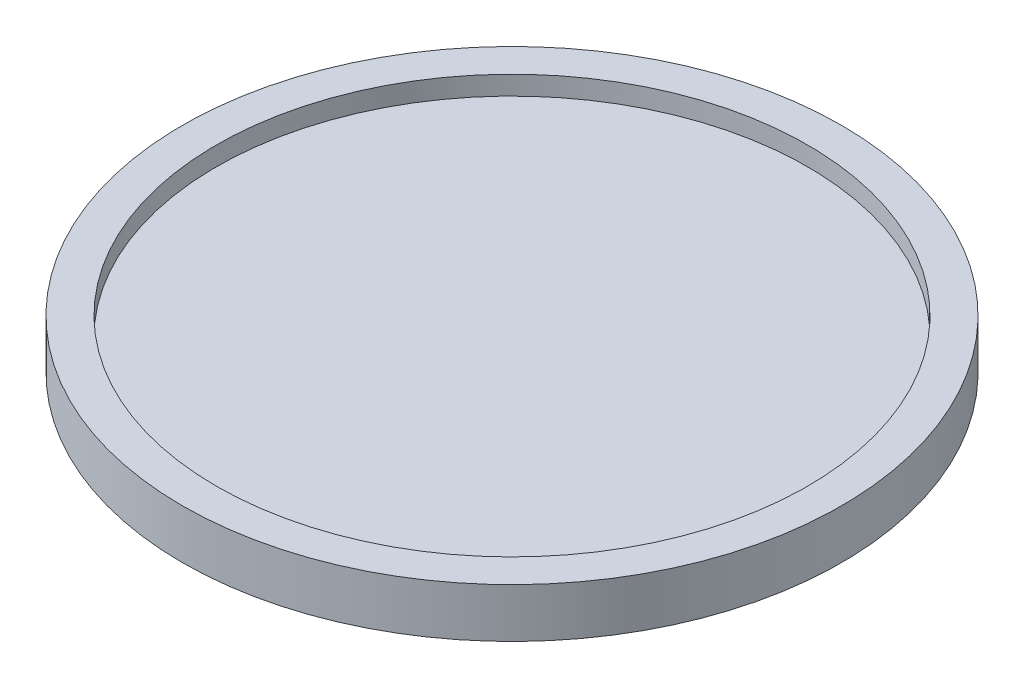
ISO-10303-21;
HEADER;
FILE_DESCRIPTION(('STEP AP214'),'2;1');
FILE_NAME('part.step','',(''),(''),'','','');
FILE_SCHEMA(('AUTOMOTIVE_DESIGN { 1 0 10303 214 1 1 1 1 }'));
ENDSEC;
DATA;
#1=APPLICATION_CONTEXT('core data for automotive mechanical design processes');
#2=APPLICATION_PROTOCOL_DEFINITION('international standard','automotive_design',2000,#1);
#3=PRODUCT_CONTEXT('',#1,'mechanical');
#4=PRODUCT('Part','Part','',(#3));
#5=PRODUCT_RELATED_PRODUCT_CATEGORY('part','',(#4));
#6=PRODUCT_DEFINITION_FORMATION('','',#4);
#7=PRODUCT_DEFINITION_CONTEXT('part definition',#1,'design');
#8=PRODUCT_DEFINITION('design','',#6,#7);
#9=PRODUCT_DEFINITION_SHAPE('','',#8);
#10=(LENGTH_UNIT() NAMED_UNIT(*) SI_UNIT(.MILLI.,.METRE.));
#11=(NAMED_UNIT(*) PLANE_ANGLE_UNIT() SI_UNIT($,.RADIAN.));
#12=(NAMED_UNIT(*) SI_UNIT($,.STERADIAN.) SOLID_ANGLE_UNIT());
#13=UNCERTAINTY_MEASURE_WITH_UNIT(LENGTH_MEASURE(1.E-05),#10,'distance_accuracy_value','');
#14=(GEOMETRIC_REPRESENTATION_CONTEXT(3) GLOBAL_UNCERTAINTY_ASSIGNED_CONTEXT((#13)) GLOBAL_UNIT_ASSIGNED_CONTEXT((#10,
#11,#12)) REPRESENTATION_CONTEXT('',''));
#15=CARTESIAN_POINT('',(0.,0.,0.));
#16=DIRECTION('',(0.,0.,1.));
#17=DIRECTION('',(1.,0.,0.));
#18=AXIS2_PLACEMENT_3D('',#15,#16,#17);
#19=CARTESIAN_POINT('',(0.,4.,0.));
#20=DIRECTION('',(0.,-1.,0.));
#21=DIRECTION('',(0.,0.,-1.));
#22=AXIS2_PLACEMENT_3D('',#19,#20,#21);
#23=CYLINDRICAL_SURFACE('',#22,43.5);
#24=CARTESIAN_POINT('',(0.,0.,0.));
#25=DIRECTION('',(0.,1.,0.));
#26=DIRECTION('',(0.,0.,1.));
#27=AXIS2_PLACEMENT_3D('',#24,#25,#26);
#28=CIRCLE('',#27,43.5);
#29=CARTESIAN_POINT('',(0.,0.,43.5));
#30=VERTEX_POINT('',#29);
#31=EDGE_CURVE('E41',#30,#30,#28,.T.);
#32=ORIENTED_EDGE('',*,*,#31,.T.);
#33=EDGE_LOOP('',(#32));
#34=FACE_BOUND('',#33,.T.);
#35=CARTESIAN_POINT('',(0.,6.5,0.));
#36=DIRECTION('',(0.,1.,0.));
#37=DIRECTION('',(0.,0.,1.));
#38=AXIS2_PLACEMENT_3D('',#35,#36,#37);
#39=CIRCLE('',#38,43.5);
#40=CARTESIAN_POINT('',(0.,6.5,43.5));
#41=VERTEX_POINT('',#40);
#42=EDGE_CURVE('E45',#41,#41,#39,.T.);
#43=ORIENTED_EDGE('',*,*,#42,.F.);
#44=EDGE_LOOP('',(#43));
#45=FACE_BOUND('',#44,.T.);
#46=ADVANCED_FACE('F31',(#34,#45),#23,.T.);
#47=CARTESIAN_POINT('',(0.,0.,0.));
#48=DIRECTION('',(0.,1.,0.));
#49=DIRECTION('',(0.,0.,1.));
#50=AXIS2_PLACEMENT_3D('',#47,#48,#49);
#51=PLANE('',#50);
#52=CARTESIAN_POINT('',(0.,0.,0.));
#53=DIRECTION('',(0.,1.,0.));
#54=DIRECTION('',(0.,0.,1.));
#55=AXIS2_PLACEMENT_3D('',#52,#53,#54);
#56=CIRCLE('',#55,38.3109981102434);
#57=CARTESIAN_POINT('',(0.,0.,38.3109981102434));
#58=VERTEX_POINT('',#57);
#59=EDGE_CURVE('E10',#58,#58,#56,.F.);
#60=ORIENTED_EDGE('',*,*,#59,.F.);
#61=EDGE_LOOP('',(#60));
#62=FACE_BOUND('',#61,.T.);
#63=ORIENTED_EDGE('',*,*,#31,.F.);
#64=EDGE_LOOP('',(#63));
#65=FACE_BOUND('',#64,.T.);
#66=ADVANCED_FACE('F83',(#62,#65),#51,.F.);
#67=CARTESIAN_POINT('',(0.,6.5,0.));
#68=DIRECTION('',(0.,1.,0.));
#69=DIRECTION('',(0.,0.,1.));
#70=AXIS2_PLACEMENT_3D('',#67,#68,#69);
#71=PLANE('',#70);
#72=ORIENTED_EDGE('',*,*,#42,.T.);
#73=EDGE_LOOP('',(#72));
#74=FACE_BOUND('',#73,.T.);
#75=CARTESIAN_POINT('',(0.,6.5,0.));
#76=DIRECTION('',(0.,1.,0.));
#77=DIRECTION('',(0.,0.,1.));
#78=AXIS2_PLACEMENT_3D('',#75,#76,#77);
#79=CIRCLE('',#78,39.0179072133184);
#80=CARTESIAN_POINT('',(0.,6.5,39.0179072133184));
#81=VERTEX_POINT('',#80);
#82=EDGE_CURVE('E50',#81,#81,#79,.T.);
#83=ORIENTED_EDGE('',*,*,#82,.F.);
#84=EDGE_LOOP('',(#83));
#85=FACE_BOUND('',#84,.T.);
#86=ADVANCED_FACE('F88',(#74,#85),#71,.T.);
#87=CARTESIAN_POINT('',(0.,6.5,0.));
#88=DIRECTION('',(0.,-1.,0.));
#89=DIRECTION('',(0.,0.,-1.));
#90=AXIS2_PLACEMENT_3D('',#87,#88,#89);
#91=CYLINDRICAL_SURFACE('',#90,39.0179072133184);
#92=ORIENTED_EDGE('',*,*,#82,.T.);
#93=EDGE_LOOP('',(#92));
#94=FACE_BOUND('',#93,.T.);
#95=CARTESIAN_POINT('',(0.,4.,0.));
#96=DIRECTION('',(0.,1.,0.));
#97=DIRECTION('',(0.,0.,1.));
#98=AXIS2_PLACEMENT_3D('',#95,#96,#97);
#99=CIRCLE('',#98,39.0179072133184);
#100=CARTESIAN_POINT('',(0.,4.,39.0179072133184));
#101=VERTEX_POINT('',#100);
#102=EDGE_CURVE('E37',#101,#101,#99,.F.);
#103=ORIENTED_EDGE('',*,*,#102,.T.);
#104=EDGE_LOOP('',(#103));
#105=FACE_BOUND('',#104,.T.);
#106=ADVANCED_FACE('F78',(#94,#105),#91,.F.);
#107=CARTESIAN_POINT('',(0.,4.,0.));
#108=DIRECTION('',(0.,1.,0.));
#109=DIRECTION('',(0.,0.,1.));
#110=AXIS2_PLACEMENT_3D('',#107,#108,#109);
#111=PLANE('',#110);
#112=ORIENTED_EDGE('',*,*,#102,.F.);
#113=EDGE_LOOP('',(#112));
#114=FACE_BOUND('',#113,.T.);
#115=ADVANCED_FACE('F69',(#114),#111,.T.);
#116=CARTESIAN_POINT('',(0.,-2.5,0.));
#117=DIRECTION('',(0.,-1.,0.));
#118=DIRECTION('',(0.,0.,-1.));
#119=AXIS2_PLACEMENT_3D('',#116,#117,#118);
#120=PLANE('',#119);
#121=CARTESIAN_POINT('',(0.,-2.5,0.));
#122=DIRECTION('',(0.,-1.,0.));
#123=DIRECTION('',(0.,0.,-1.));
#124=AXIS2_PLACEMENT_3D('',#121,#122,#123);
#125=CIRCLE('',#124,38.3109981102434);
#126=CARTESIAN_POINT('',(0.,-2.5,-38.3109981102434));
#127=VERTEX_POINT('',#126);
#128=EDGE_CURVE('E53',#127,#127,#125,.T.);
#129=ORIENTED_EDGE('',*,*,#128,.T.);
#130=EDGE_LOOP('',(#129));
#131=FACE_BOUND('',#130,.T.);
#132=CARTESIAN_POINT('',(0.,-2.5,0.));
#133=DIRECTION('',(0.,-1.,0.));
#134=DIRECTION('',(0.,0.,-1.));
#135=AXIS2_PLACEMENT_3D('',#132,#133,#134);
#136=CIRCLE('',#135,33.604332006848);
#137=CARTESIAN_POINT('',(0.,-2.5,-33.604332006848));
#138=VERTEX_POINT('',#137);
#139=EDGE_CURVE('E56',#138,#138,#136,.T.);
#140=ORIENTED_EDGE('',*,*,#139,.F.);
#141=EDGE_LOOP('',(#140));
#142=FACE_BOUND('',#141,.T.);
#143=ADVANCED_FACE('F66',(#131,#142),#120,.T.);
#144=CARTESIAN_POINT('',(0.,-2.5,0.));
#145=DIRECTION('',(0.,1.,0.));
#146=DIRECTION('',(0.,0.,1.));
#147=AXIS2_PLACEMENT_3D('',#144,#145,#146);
#148=CYLINDRICAL_SURFACE('',#147,38.3109981102434);
#149=ORIENTED_EDGE('',*,*,#128,.F.);
#150=EDGE_LOOP('',(#149));
#151=FACE_BOUND('',#150,.T.);
#152=ORIENTED_EDGE('',*,*,#59,.T.);
#153=EDGE_LOOP('',(#152));
#154=FACE_BOUND('',#153,.T.);
#155=ADVANCED_FACE('F68',(#151,#154),#148,.T.);
#156=CARTESIAN_POINT('',(0.,-2.5,0.));
#157=DIRECTION('',(0.,1.,0.));
#158=DIRECTION('',(0.,0.,1.));
#159=AXIS2_PLACEMENT_3D('',#156,#157,#158);
#160=CYLINDRICAL_SURFACE('',#159,33.604332006848);
#161=ORIENTED_EDGE('',*,*,#139,.T.);
#162=EDGE_LOOP('',(#161));
#163=FACE_BOUND('',#162,.T.);
#164=CARTESIAN_POINT('',(0.,0.,0.));
#165=DIRECTION('',(0.,-1.,0.));
#166=DIRECTION('',(0.,0.,-1.));
#167=AXIS2_PLACEMENT_3D('',#164,#165,#166);
#168=CIRCLE('',#167,33.604332006848);
#169=CARTESIAN_POINT('',(0.,0.,-33.604332006848));
#170=VERTEX_POINT('',#169);
#171=EDGE_CURVE('E57',#170,#170,#168,.T.);
#172=ORIENTED_EDGE('',*,*,#171,.F.);
#173=EDGE_LOOP('',(#172));
#174=FACE_BOUND('',#173,.T.);
#175=ADVANCED_FACE('F63',(#163,#174),#160,.F.);
#176=ORIENTED_EDGE('',*,*,#171,.T.);
#177=EDGE_LOOP('',(#176));
#178=FACE_BOUND('',#177,.T.);
#179=ADVANCED_FACE('F90',(#178),#51,.F.);
#180=CLOSED_SHELL('',(#46,#66,#86,#106,#115,#143,#155,#175,#179));
#181=MANIFOLD_SOLID_BREP('B2',#180);
#182=ADVANCED_BREP_SHAPE_REPRESENTATION('',(#18,#181),#14);
#183=SHAPE_DEFINITION_REPRESENTATION(#9,#182);
ENDSEC;
END-ISO-10303-21;
